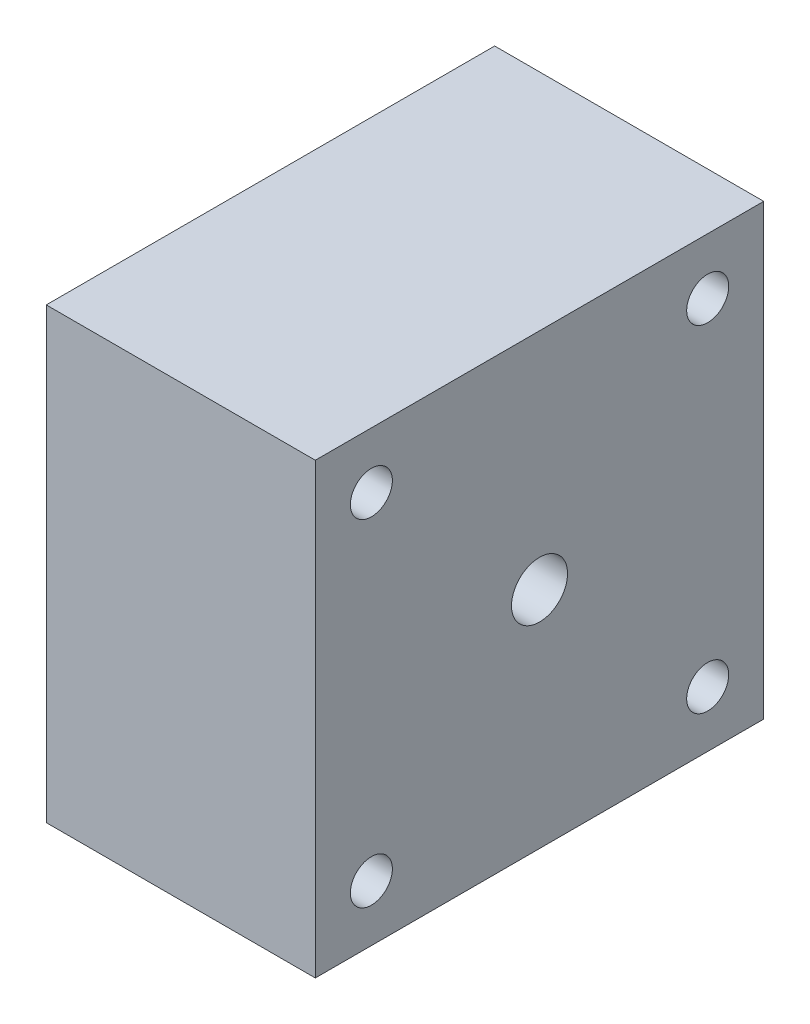
ISO-10303-21;
HEADER;
FILE_DESCRIPTION(('STEP AP214'),'2;1');
FILE_NAME('part.step','',(''),(''),'','','');
FILE_SCHEMA(('AUTOMOTIVE_DESIGN { 1 0 10303 214 1 1 1 1 }'));
ENDSEC;
DATA;
#1=APPLICATION_CONTEXT('core data for automotive mechanical design processes');
#2=APPLICATION_PROTOCOL_DEFINITION('international standard','automotive_design',2000,#1);
#3=PRODUCT_CONTEXT('',#1,'mechanical');
#4=PRODUCT('Part','Part','',(#3));
#5=PRODUCT_RELATED_PRODUCT_CATEGORY('part','',(#4));
#6=PRODUCT_DEFINITION_FORMATION('','',#4);
#7=PRODUCT_DEFINITION_CONTEXT('part definition',#1,'design');
#8=PRODUCT_DEFINITION('design','',#6,#7);
#9=PRODUCT_DEFINITION_SHAPE('','',#8);
#10=(LENGTH_UNIT() NAMED_UNIT(*) SI_UNIT(.MILLI.,.METRE.));
#11=(NAMED_UNIT(*) PLANE_ANGLE_UNIT() SI_UNIT($,.RADIAN.));
#12=(NAMED_UNIT(*) SI_UNIT($,.STERADIAN.) SOLID_ANGLE_UNIT());
#13=UNCERTAINTY_MEASURE_WITH_UNIT(LENGTH_MEASURE(1.E-05),#10,'distance_accuracy_value','');
#14=(GEOMETRIC_REPRESENTATION_CONTEXT(3) GLOBAL_UNCERTAINTY_ASSIGNED_CONTEXT((#13)) GLOBAL_UNIT_ASSIGNED_CONTEXT((#10,
#11,#12)) REPRESENTATION_CONTEXT('',''));
#15=CARTESIAN_POINT('',(0.,0.,0.));
#16=DIRECTION('',(0.,0.,1.));
#17=DIRECTION('',(1.,0.,0.));
#18=AXIS2_PLACEMENT_3D('',#15,#16,#17);
#19=CARTESIAN_POINT('',(0.,50.8,0.));
#20=DIRECTION('',(-1.,0.,0.));
#21=DIRECTION('',(0.,0.,1.));
#22=AXIS2_PLACEMENT_3D('',#19,#20,#21);
#23=PLANE('',#22);
#24=CARTESIAN_POINT('',(0.,30.1624999999995,-33.6488919710466));
#25=DIRECTION('',(-1.,0.,0.));
#26=DIRECTION('',(0.,0.,1.));
#27=AXIS2_PLACEMENT_3D('',#24,#25,#26);
#28=CIRCLE('',#27,1.8288);
#29=CARTESIAN_POINT('',(0.,30.1624999999995,-31.8200919710466));
#30=VERTEX_POINT('',#29);
#31=EDGE_CURVE('E415',#30,#30,#28,.T.);
#32=ORIENTED_EDGE('',*,*,#31,.F.);
#33=EDGE_LOOP('',(#32));
#34=FACE_BOUND('',#33,.T.);
#35=CARTESIAN_POINT('',(0.,20.6374999999995,-33.6488919710461));
#36=DIRECTION('',(-1.,0.,0.));
#37=DIRECTION('',(0.,0.,1.));
#38=AXIS2_PLACEMENT_3D('',#35,#36,#37);
#39=CIRCLE('',#38,1.8288);
#40=CARTESIAN_POINT('',(0.,20.6374999999995,-31.8200919710461));
#41=VERTEX_POINT('',#40);
#42=EDGE_CURVE('E409',#41,#41,#39,.T.);
#43=ORIENTED_EDGE('',*,*,#42,.F.);
#44=EDGE_LOOP('',(#43));
#45=FACE_BOUND('',#44,.T.);
#46=CARTESIAN_POINT('',(0.,15.8749999999999,-25.3999999999991));
#47=DIRECTION('',(-1.,0.,0.));
#48=DIRECTION('',(0.,0.,1.));
#49=AXIS2_PLACEMENT_3D('',#46,#47,#48);
#50=CIRCLE('',#49,1.8288);
#51=CARTESIAN_POINT('',(0.,15.8749999999999,-23.5711999999991));
#52=VERTEX_POINT('',#51);
#53=EDGE_CURVE('E403',#52,#52,#50,.T.);
#54=ORIENTED_EDGE('',*,*,#53,.F.);
#55=EDGE_LOOP('',(#54));
#56=FACE_BOUND('',#55,.T.);
#57=CARTESIAN_POINT('',(0.,20.6375000000003,-17.1511080289525));
#58=DIRECTION('',(-1.,0.,0.));
#59=DIRECTION('',(0.,0.,1.));
#60=AXIS2_PLACEMENT_3D('',#57,#58,#59);
#61=CIRCLE('',#60,1.8288);
#62=CARTESIAN_POINT('',(0.,20.6375000000003,-15.3223080289525));
#63=VERTEX_POINT('',#62);
#64=EDGE_CURVE('E397',#63,#63,#61,.T.);
#65=ORIENTED_EDGE('',*,*,#64,.F.);
#66=EDGE_LOOP('',(#65));
#67=FACE_BOUND('',#66,.T.);
#68=CARTESIAN_POINT('',(0.,30.1625000000003,-17.151108028953));
#69=DIRECTION('',(-1.,0.,0.));
#70=DIRECTION('',(0.,0.,1.));
#71=AXIS2_PLACEMENT_3D('',#68,#69,#70);
#72=CIRCLE('',#71,1.8288);
#73=CARTESIAN_POINT('',(0.,30.1625000000003,-15.322308028953));
#74=VERTEX_POINT('',#73);
#75=EDGE_CURVE('E388',#74,#74,#72,.T.);
#76=ORIENTED_EDGE('',*,*,#75,.F.);
#77=EDGE_LOOP('',(#76));
#78=FACE_BOUND('',#77,.T.);
#79=CARTESIAN_POINT('',(0.,34.9249999999999,-25.4));
#80=DIRECTION('',(-1.,0.,0.));
#81=DIRECTION('',(0.,0.,1.));
#82=AXIS2_PLACEMENT_3D('',#79,#80,#81);
#83=CIRCLE('',#82,1.8288);
#84=CARTESIAN_POINT('',(0.,34.9249999999999,-23.5712));
#85=VERTEX_POINT('',#84);
#86=EDGE_CURVE('E138',#85,#85,#83,.T.);
#87=ORIENTED_EDGE('',*,*,#86,.F.);
#88=EDGE_LOOP('',(#87));
#89=FACE_BOUND('',#88,.T.);
#90=CARTESIAN_POINT('',(0.,25.3999999999999,-25.4));
#91=DIRECTION('',(-1.,0.,0.));
#92=DIRECTION('',(0.,0.,1.));
#93=AXIS2_PLACEMENT_3D('',#90,#91,#92);
#94=CIRCLE('',#93,7.1501);
#95=CARTESIAN_POINT('',(0.,25.3999999999999,-18.2499));
#96=VERTEX_POINT('',#95);
#97=EDGE_CURVE('E129',#96,#96,#94,.F.);
#98=ORIENTED_EDGE('',*,*,#97,.T.);
#99=EDGE_LOOP('',(#98));
#100=FACE_BOUND('',#99,.T.);
#101=CARTESIAN_POINT('',(0.,44.4500000000001,-44.4499999999801));
#102=DIRECTION('',(-1.,0.,0.));
#103=DIRECTION('',(0.,0.,1.));
#104=AXIS2_PLACEMENT_3D('',#101,#102,#103);
#105=CIRCLE('',#104,2.38125);
#106=CARTESIAN_POINT('',(0.,44.4500000000001,-42.0687499999801));
#107=VERTEX_POINT('',#106);
#108=EDGE_CURVE('E119',#107,#107,#105,.F.);
#109=ORIENTED_EDGE('',*,*,#108,.T.);
#110=EDGE_LOOP('',(#109));
#111=FACE_BOUND('',#110,.T.);
#112=CARTESIAN_POINT('',(0.,6.35000000000006,-44.4499999999802));
#113=DIRECTION('',(-1.,0.,0.));
#114=DIRECTION('',(0.,0.,1.));
#115=AXIS2_PLACEMENT_3D('',#112,#113,#114);
#116=CIRCLE('',#115,2.38125);
#117=CARTESIAN_POINT('',(0.,6.35000000000006,-42.0687499999801));
#118=VERTEX_POINT('',#117);
#119=EDGE_CURVE('E110',#118,#118,#116,.F.);
#120=ORIENTED_EDGE('',*,*,#119,.T.);
#121=EDGE_LOOP('',(#120));
#122=FACE_BOUND('',#121,.T.);
#123=DIRECTION('',(0.,-1.,0.));
#124=VECTOR('',#123,1.);
#125=CARTESIAN_POINT('',(0.,0.,0.));
#126=LINE('',#125,#124);
#127=CARTESIAN_POINT('',(0.,50.8,0.));
#128=VERTEX_POINT('',#127);
#129=CARTESIAN_POINT('',(0.,0.,0.));
#130=VERTEX_POINT('',#129);
#131=EDGE_CURVE('E101',#128,#130,#126,.T.);
#132=ORIENTED_EDGE('',*,*,#131,.F.);
#133=DIRECTION('',(0.,0.,1.));
#134=VECTOR('',#133,1.);
#135=CARTESIAN_POINT('',(0.,50.8,0.));
#136=LINE('',#135,#134);
#137=CARTESIAN_POINT('',(0.,50.8,-50.8));
#138=VERTEX_POINT('',#137);
#139=EDGE_CURVE('E75',#138,#128,#136,.T.);
#140=ORIENTED_EDGE('',*,*,#139,.F.);
#141=DIRECTION('',(0.,1.,0.));
#142=VECTOR('',#141,1.);
#143=CARTESIAN_POINT('',(0.,0.,-50.8));
#144=LINE('',#143,#142);
#145=CARTESIAN_POINT('',(0.,0.,-50.8));
#146=VERTEX_POINT('',#145);
#147=EDGE_CURVE('E69',#146,#138,#144,.T.);
#148=ORIENTED_EDGE('',*,*,#147,.F.);
#149=DIRECTION('',(0.,0.,-1.));
#150=VECTOR('',#149,1.);
#151=CARTESIAN_POINT('',(0.,0.,0.));
#152=LINE('',#151,#150);
#153=EDGE_CURVE('E92',#130,#146,#152,.T.);
#154=ORIENTED_EDGE('',*,*,#153,.F.);
#155=EDGE_LOOP('',(#132,#140,#148,#154));
#156=FACE_BOUND('',#155,.T.);
#157=CARTESIAN_POINT('',(0.,44.4500000000118,-6.34999999996307));
#158=DIRECTION('',(-1.,0.,0.));
#159=DIRECTION('',(0.,0.,1.));
#160=AXIS2_PLACEMENT_3D('',#157,#158,#159);
#161=CIRCLE('',#160,2.38125);
#162=CARTESIAN_POINT('',(0.,44.4500000000118,-3.96874999996307));
#163=VERTEX_POINT('',#162);
#164=EDGE_CURVE('E115',#163,#163,#161,.F.);
#165=ORIENTED_EDGE('',*,*,#164,.T.);
#166=EDGE_LOOP('',(#165));
#167=FACE_BOUND('',#166,.T.);
#168=CARTESIAN_POINT('',(0.,6.35000000000004,-6.34999999998015));
#169=DIRECTION('',(-1.,0.,0.));
#170=DIRECTION('',(0.,0.,1.));
#171=AXIS2_PLACEMENT_3D('',#168,#169,#170);
#172=CIRCLE('',#171,2.38125);
#173=CARTESIAN_POINT('',(0.,6.35000000000004,-3.96874999998015));
#174=VERTEX_POINT('',#173);
#175=EDGE_CURVE('E122',#174,#174,#172,.F.);
#176=ORIENTED_EDGE('',*,*,#175,.T.);
#177=EDGE_LOOP('',(#176));
#178=FACE_BOUND('',#177,.T.);
#179=ADVANCED_FACE('F33',(#34,#45,#56,#67,#78,#89,#100,#111,#122,#156,#167,#178),#23,.T.);
#180=CARTESIAN_POINT('',(30.48,50.8,0.));
#181=DIRECTION('',(-1.,0.,0.));
#182=DIRECTION('',(0.,0.,1.));
#183=AXIS2_PLACEMENT_3D('',#180,#181,#182);
#184=PLANE('',#183);
#185=CARTESIAN_POINT('',(30.48,44.4500000000001,-44.4499999999799));
#186=DIRECTION('',(-1.,0.,0.));
#187=DIRECTION('',(0.,0.,1.));
#188=AXIS2_PLACEMENT_3D('',#185,#186,#187);
#189=CIRCLE('',#188,2.38125);
#190=CARTESIAN_POINT('',(30.48,44.4500000000001,-42.0687499999799));
#191=VERTEX_POINT('',#190);
#192=EDGE_CURVE('E118',#191,#191,#189,.F.);
#193=ORIENTED_EDGE('',*,*,#192,.F.);
#194=EDGE_LOOP('',(#193));
#195=FACE_BOUND('',#194,.T.);
#196=CARTESIAN_POINT('',(30.48,6.35000000000005,-44.44999999998));
#197=DIRECTION('',(-1.,0.,0.));
#198=DIRECTION('',(0.,0.,1.));
#199=AXIS2_PLACEMENT_3D('',#196,#197,#198);
#200=CIRCLE('',#199,2.38125);
#201=CARTESIAN_POINT('',(30.48,6.35000000000005,-42.0687499999799));
#202=VERTEX_POINT('',#201);
#203=EDGE_CURVE('E113',#202,#202,#200,.F.);
#204=ORIENTED_EDGE('',*,*,#203,.F.);
#205=EDGE_LOOP('',(#204));
#206=FACE_BOUND('',#205,.T.);
#207=DIRECTION('',(0.,-1.,0.));
#208=VECTOR('',#207,1.);
#209=CARTESIAN_POINT('',(30.48,0.,0.));
#210=LINE('',#209,#208);
#211=CARTESIAN_POINT('',(30.48,50.8,0.));
#212=VERTEX_POINT('',#211);
#213=CARTESIAN_POINT('',(30.48,0.,0.));
#214=VERTEX_POINT('',#213);
#215=EDGE_CURVE('E88',#212,#214,#210,.T.);
#216=ORIENTED_EDGE('',*,*,#215,.T.);
#217=DIRECTION('',(0.,0.,-1.));
#218=VECTOR('',#217,1.);
#219=CARTESIAN_POINT('',(30.48,0.,0.));
#220=LINE('',#219,#218);
#221=CARTESIAN_POINT('',(30.48,0.,-50.8));
#222=VERTEX_POINT('',#221);
#223=EDGE_CURVE('E82',#214,#222,#220,.T.);
#224=ORIENTED_EDGE('',*,*,#223,.T.);
#225=DIRECTION('',(0.,1.,0.));
#226=VECTOR('',#225,1.);
#227=CARTESIAN_POINT('',(30.48,0.,-50.8));
#228=LINE('',#227,#226);
#229=CARTESIAN_POINT('',(30.48,50.8,-50.8));
#230=VERTEX_POINT('',#229);
#231=EDGE_CURVE('E86',#222,#230,#228,.T.);
#232=ORIENTED_EDGE('',*,*,#231,.T.);
#233=DIRECTION('',(0.,0.,1.));
#234=VECTOR('',#233,1.);
#235=CARTESIAN_POINT('',(30.48,50.8,0.));
#236=LINE('',#235,#234);
#237=EDGE_CURVE('E52',#230,#212,#236,.T.);
#238=ORIENTED_EDGE('',*,*,#237,.T.);
#239=EDGE_LOOP('',(#216,#224,#232,#238));
#240=FACE_BOUND('',#239,.T.);
#241=CARTESIAN_POINT('',(30.48,25.4,-25.4));
#242=DIRECTION('',(-1.,0.,0.));
#243=DIRECTION('',(0.,0.,1.));
#244=AXIS2_PLACEMENT_3D('',#241,#242,#243);
#245=CIRCLE('',#244,3.175);
#246=CARTESIAN_POINT('',(30.48,26.7918357861171,-28.2536674901754));
#247=VERTEX_POINT('',#246);
#248=EDGE_CURVE('E104',#247,#247,#245,.F.);
#249=ORIENTED_EDGE('',*,*,#248,.F.);
#250=EDGE_LOOP('',(#249));
#251=FACE_BOUND('',#250,.T.);
#252=CARTESIAN_POINT('',(30.48,44.4500000000118,-6.34999999996307));
#253=DIRECTION('',(-1.,0.,0.));
#254=DIRECTION('',(0.,0.,1.));
#255=AXIS2_PLACEMENT_3D('',#252,#253,#254);
#256=CIRCLE('',#255,2.38125);
#257=CARTESIAN_POINT('',(30.48,44.4500000000118,-3.96874999996307));
#258=VERTEX_POINT('',#257);
#259=EDGE_CURVE('E114',#258,#258,#256,.F.);
#260=ORIENTED_EDGE('',*,*,#259,.F.);
#261=EDGE_LOOP('',(#260));
#262=FACE_BOUND('',#261,.T.);
#263=CARTESIAN_POINT('',(30.48,6.35000000000004,-6.34999999997995));
#264=DIRECTION('',(-1.,0.,0.));
#265=DIRECTION('',(0.,0.,1.));
#266=AXIS2_PLACEMENT_3D('',#263,#264,#265);
#267=CIRCLE('',#266,2.38125);
#268=CARTESIAN_POINT('',(30.48,6.35000000000004,-3.96874999997995));
#269=VERTEX_POINT('',#268);
#270=EDGE_CURVE('E121',#269,#269,#267,.F.);
#271=ORIENTED_EDGE('',*,*,#270,.F.);
#272=EDGE_LOOP('',(#271));
#273=FACE_BOUND('',#272,.T.);
#274=ADVANCED_FACE('F83',(#195,#206,#240,#251,#262,#273),#184,.F.);
#275=CARTESIAN_POINT('',(30.48,0.,0.));
#276=DIRECTION('',(0.,0.,-1.));
#277=DIRECTION('',(-1.,0.,0.));
#278=AXIS2_PLACEMENT_3D('',#275,#276,#277);
#279=PLANE('',#278);
#280=ORIENTED_EDGE('',*,*,#131,.T.);
#281=DIRECTION('',(-1.,0.,0.));
#282=VECTOR('',#281,1.);
#283=CARTESIAN_POINT('',(30.48,0.,0.));
#284=LINE('',#283,#282);
#285=EDGE_CURVE('E11',#214,#130,#284,.T.);
#286=ORIENTED_EDGE('',*,*,#285,.F.);
#287=ORIENTED_EDGE('',*,*,#215,.F.);
#288=DIRECTION('',(-1.,0.,0.));
#289=VECTOR('',#288,1.);
#290=CARTESIAN_POINT('',(30.48,50.8,0.));
#291=LINE('',#290,#289);
#292=EDGE_CURVE('E97',#212,#128,#291,.T.);
#293=ORIENTED_EDGE('',*,*,#292,.T.);
#294=EDGE_LOOP('',(#280,#286,#287,#293));
#295=FACE_BOUND('',#294,.T.);
#296=ADVANCED_FACE('F35',(#295),#279,.F.);
#297=CARTESIAN_POINT('',(30.48,0.,0.));
#298=DIRECTION('',(0.,1.,0.));
#299=DIRECTION('',(0.,0.,1.));
#300=AXIS2_PLACEMENT_3D('',#297,#298,#299);
#301=PLANE('',#300);
#302=ORIENTED_EDGE('',*,*,#153,.T.);
#303=DIRECTION('',(-1.,0.,0.));
#304=VECTOR('',#303,1.);
#305=CARTESIAN_POINT('',(30.48,0.,-50.8));
#306=LINE('',#305,#304);
#307=EDGE_CURVE('E43',#222,#146,#306,.T.);
#308=ORIENTED_EDGE('',*,*,#307,.F.);
#309=ORIENTED_EDGE('',*,*,#223,.F.);
#310=ORIENTED_EDGE('',*,*,#285,.T.);
#311=EDGE_LOOP('',(#302,#308,#309,#310));
#312=FACE_BOUND('',#311,.T.);
#313=ADVANCED_FACE('F91',(#312),#301,.F.);
#314=CARTESIAN_POINT('',(30.48,0.,-50.8));
#315=DIRECTION('',(0.,0.,1.));
#316=DIRECTION('',(1.,0.,0.));
#317=AXIS2_PLACEMENT_3D('',#314,#315,#316);
#318=PLANE('',#317);
#319=ORIENTED_EDGE('',*,*,#147,.T.);
#320=DIRECTION('',(-1.,0.,0.));
#321=VECTOR('',#320,1.);
#322=CARTESIAN_POINT('',(30.48,50.8,-50.8));
#323=LINE('',#322,#321);
#324=EDGE_CURVE('E93',#230,#138,#323,.T.);
#325=ORIENTED_EDGE('',*,*,#324,.F.);
#326=ORIENTED_EDGE('',*,*,#231,.F.);
#327=ORIENTED_EDGE('',*,*,#307,.T.);
#328=EDGE_LOOP('',(#319,#325,#326,#327));
#329=FACE_BOUND('',#328,.T.);
#330=ADVANCED_FACE('F95',(#329),#318,.F.);
#331=CARTESIAN_POINT('',(30.48,50.8,0.));
#332=DIRECTION('',(0.,-1.,0.));
#333=DIRECTION('',(0.,0.,-1.));
#334=AXIS2_PLACEMENT_3D('',#331,#332,#333);
#335=PLANE('',#334);
#336=ORIENTED_EDGE('',*,*,#139,.T.);
#337=ORIENTED_EDGE('',*,*,#292,.F.);
#338=ORIENTED_EDGE('',*,*,#237,.F.);
#339=ORIENTED_EDGE('',*,*,#324,.T.);
#340=EDGE_LOOP('',(#336,#337,#338,#339));
#341=FACE_BOUND('',#340,.T.);
#342=ADVANCED_FACE('F185',(#341),#335,.F.);
#343=CARTESIAN_POINT('',(-16.0827684200193,25.4,-25.4));
#344=DIRECTION('',(1.,0.,0.));
#345=DIRECTION('',(0.,0.438373475942388,-0.898792910291458));
#346=AXIS2_PLACEMENT_3D('',#343,#344,#345);
#347=CYLINDRICAL_SURFACE('',#346,3.175);
#348=CARTESIAN_POINT('',(24.13,25.4,-25.4));
#349=DIRECTION('',(1.,0.,0.));
#350=DIRECTION('',(0.,0.,-1.));
#351=AXIS2_PLACEMENT_3D('',#348,#349,#350);
#352=CIRCLE('',#351,3.175);
#353=CARTESIAN_POINT('',(24.13,26.7918357861171,-28.2536674901754));
#354=VERTEX_POINT('',#353);
#355=EDGE_CURVE('E37',#354,#354,#352,.T.);
#356=CARTESIAN_POINT('',(24.13,26.7918357861171,-28.2536674901754));
#357=CARTESIAN_POINT('',(24.1961458333334,26.7918357861171,-28.2536674901754));
#358=CARTESIAN_POINT('',(24.2622916666667,26.7918357861171,-28.2536674901754));
#359=CARTESIAN_POINT('',(24.3945833333334,26.7918357861171,-28.2536674901754));
#360=CARTESIAN_POINT('',(24.4607291666667,26.7918357861171,-28.2536674901754));
#361=CARTESIAN_POINT('',(24.5930208333334,26.7918357861171,-28.2536674901754));
#362=CARTESIAN_POINT('',(24.6591666666667,26.7918357861171,-28.2536674901754));
#363=CARTESIAN_POINT('',(24.7914583333334,26.7918357861171,-28.2536674901754));
#364=CARTESIAN_POINT('',(24.8576041666667,26.7918357861171,-28.2536674901754));
#365=CARTESIAN_POINT('',(24.9898958333334,26.7918357861171,-28.2536674901754));
#366=CARTESIAN_POINT('',(25.0560416666667,26.7918357861171,-28.2536674901754));
#367=CARTESIAN_POINT('',(25.1883333333334,26.7918357861171,-28.2536674901754));
#368=CARTESIAN_POINT('',(25.2544791666667,26.7918357861171,-28.2536674901754));
#369=CARTESIAN_POINT('',(25.3867708333334,26.7918357861171,-28.2536674901754));
#370=CARTESIAN_POINT('',(25.4529166666667,26.7918357861171,-28.2536674901754));
#371=CARTESIAN_POINT('',(25.5852083333334,26.7918357861171,-28.2536674901754));
#372=CARTESIAN_POINT('',(25.6513541666667,26.7918357861171,-28.2536674901754));
#373=CARTESIAN_POINT('',(25.7836458333334,26.7918357861171,-28.2536674901754));
#374=CARTESIAN_POINT('',(25.8497916666667,26.7918357861171,-28.2536674901754));
#375=CARTESIAN_POINT('',(25.9820833333333,26.7918357861171,-28.2536674901754));
#376=CARTESIAN_POINT('',(26.0482291666667,26.7918357861171,-28.2536674901754));
#377=CARTESIAN_POINT('',(26.1805208333334,26.7918357861171,-28.2536674901754));
#378=CARTESIAN_POINT('',(26.2466666666667,26.7918357861171,-28.2536674901754));
#379=CARTESIAN_POINT('',(26.3789583333334,26.7918357861171,-28.2536674901754));
#380=CARTESIAN_POINT('',(26.4451041666667,26.7918357861171,-28.2536674901754));
#381=CARTESIAN_POINT('',(26.5773958333333,26.7918357861171,-28.2536674901754));
#382=CARTESIAN_POINT('',(26.6435416666667,26.7918357861171,-28.2536674901754));
#383=CARTESIAN_POINT('',(26.7758333333333,26.7918357861171,-28.2536674901754));
#384=CARTESIAN_POINT('',(26.8419791666667,26.7918357861171,-28.2536674901754));
#385=CARTESIAN_POINT('',(26.9742708333333,26.7918357861171,-28.2536674901754));
#386=CARTESIAN_POINT('',(27.0404166666667,26.7918357861171,-28.2536674901754));
#387=CARTESIAN_POINT('',(27.1727083333333,26.7918357861171,-28.2536674901754));
#388=CARTESIAN_POINT('',(27.2388541666667,26.7918357861171,-28.2536674901754));
#389=CARTESIAN_POINT('',(27.3711458333333,26.7918357861171,-28.2536674901754));
#390=CARTESIAN_POINT('',(27.4372916666667,26.7918357861171,-28.2536674901754));
#391=CARTESIAN_POINT('',(27.5695833333333,26.7918357861171,-28.2536674901754));
#392=CARTESIAN_POINT('',(27.6357291666667,26.7918357861171,-28.2536674901754));
#393=CARTESIAN_POINT('',(27.7680208333333,26.7918357861171,-28.2536674901754));
#394=CARTESIAN_POINT('',(27.8341666666667,26.7918357861171,-28.2536674901754));
#395=CARTESIAN_POINT('',(27.9664583333333,26.7918357861171,-28.2536674901754));
#396=CARTESIAN_POINT('',(28.0326041666667,26.7918357861171,-28.2536674901754));
#397=CARTESIAN_POINT('',(28.1648958333333,26.7918357861171,-28.2536674901754));
#398=CARTESIAN_POINT('',(28.2310416666667,26.7918357861171,-28.2536674901754));
#399=CARTESIAN_POINT('',(28.3633333333333,26.7918357861171,-28.2536674901754));
#400=CARTESIAN_POINT('',(28.4294791666667,26.7918357861171,-28.2536674901754));
#401=CARTESIAN_POINT('',(28.5617708333333,26.7918357861171,-28.2536674901754));
#402=CARTESIAN_POINT('',(28.6279166666667,26.7918357861171,-28.2536674901754));
#403=CARTESIAN_POINT('',(28.7602083333333,26.7918357861171,-28.2536674901754));
#404=CARTESIAN_POINT('',(28.8263541666667,26.7918357861171,-28.2536674901754));
#405=CARTESIAN_POINT('',(28.9586458333333,26.7918357861171,-28.2536674901754));
#406=CARTESIAN_POINT('',(29.0247916666667,26.7918357861171,-28.2536674901754));
#407=CARTESIAN_POINT('',(29.1570833333333,26.7918357861171,-28.2536674901754));
#408=CARTESIAN_POINT('',(29.2232291666667,26.7918357861171,-28.2536674901754));
#409=CARTESIAN_POINT('',(29.3555208333333,26.7918357861171,-28.2536674901754));
#410=CARTESIAN_POINT('',(29.4216666666667,26.7918357861171,-28.2536674901754));
#411=CARTESIAN_POINT('',(29.5539583333333,26.7918357861171,-28.2536674901754));
#412=CARTESIAN_POINT('',(29.6201041666667,26.7918357861171,-28.2536674901754));
#413=CARTESIAN_POINT('',(29.7523958333333,26.7918357861171,-28.2536674901754));
#414=CARTESIAN_POINT('',(29.8185416666667,26.7918357861171,-28.2536674901754));
#415=CARTESIAN_POINT('',(29.9508333333333,26.7918357861171,-28.2536674901754));
#416=CARTESIAN_POINT('',(30.0169791666667,26.7918357861171,-28.2536674901754));
#417=CARTESIAN_POINT('',(30.1492708333333,26.7918357861171,-28.2536674901754));
#418=CARTESIAN_POINT('',(30.2154166666667,26.7918357861171,-28.2536674901754));
#419=CARTESIAN_POINT('',(30.3477083333333,26.7918357861171,-28.2536674901754));
#420=CARTESIAN_POINT('',(30.4138541666667,26.7918357861171,-28.2536674901754));
#421=CARTESIAN_POINT('',(30.48,26.7918357861171,-28.2536674901754));
#422=B_SPLINE_CURVE_WITH_KNOTS('',3,(#356,#357,#358,#359,#360,#361,#362,#363,#364,#365,#366,
#367,#368,#369,#370,#371,#372,#373,#374,#375,#376,#377,#378,#379,#380,#381,#382,#383,#384,#385,
#386,#387,#388,#389,#390,#391,#392,#393,#394,#395,#396,#397,#398,#399,#400,#401,#402,#403,#404,
#405,#406,#407,#408,#409,#410,#411,#412,#413,#414,#415,#416,#417,#418,#419,#420,#421),
.UNSPECIFIED.,.F.,.F.,(4,2,2,2,2,2,2,2,2,2,2,2,2,2,2,2,2,2,2,2,2,2,2,2,2,2,2,2,2,2,2,2,4),(0.,
0.198437499999995,0.396874999999998,0.5953125,0.793749999999996,0.992187499999991,
1.19062499999999,1.3890625,1.58749999999999,1.78593749999999,1.98437499999999,2.18281249999999,
2.38124999999999,2.57968749999998,2.77812499999999,2.97656249999999,3.17499999999998,
3.37343749999998,3.57187499999998,3.77031249999998,3.96874999999998,4.16718749999997,
4.36562499999998,4.56406249999998,4.76249999999998,4.96093749999997,5.15937499999997,
5.35781249999998,5.55624999999997,5.75468749999997,5.95312499999997,6.15156249999997,
6.34999999999997),.UNSPECIFIED.);
#423=EDGE_CURVE('BSEAM151',#354,#247,#422,.T.);
#424=ORIENTED_EDGE('',*,*,#355,.F.);
#425=ORIENTED_EDGE('',*,*,#248,.T.);
#426=ORIENTED_EDGE('',*,*,#423,.T.);
#427=ORIENTED_EDGE('',*,*,#423,.F.);
#428=EDGE_LOOP('',(#424,#426,#425,#427));
#429=FACE_BOUND('',#428,.T.);
#430=ADVANCED_FACE('F151',(#429),#347,.F.);
#431=CARTESIAN_POINT('',(-48.8487684200226,6.35000000000006,-44.4499999999805));
#432=DIRECTION('',(1.,0.,0.));
#433=DIRECTION('',(0.,0.71121192391603,-0.70297766627373));
#434=AXIS2_PLACEMENT_3D('',#431,#432,#433);
#435=CYLINDRICAL_SURFACE('',#434,2.38125);
#436=ORIENTED_EDGE('',*,*,#119,.F.);
#437=EDGE_LOOP('',(#436));
#438=FACE_BOUND('',#437,.T.);
#439=ORIENTED_EDGE('',*,*,#203,.T.);
#440=EDGE_LOOP('',(#439));
#441=FACE_BOUND('',#440,.T.);
#442=ADVANCED_FACE('F203',(#438,#441),#435,.F.);
#443=CARTESIAN_POINT('',(-48.8487684200611,44.4500000000118,-6.34999999996307));
#444=DIRECTION('',(1.,0.,0.));
#445=DIRECTION('',(0.,0.52642426037138,0.850222028703353));
#446=AXIS2_PLACEMENT_3D('',#443,#444,#445);
#447=CYLINDRICAL_SURFACE('',#446,2.38125);
#448=ORIENTED_EDGE('',*,*,#164,.F.);
#449=EDGE_LOOP('',(#448));
#450=FACE_BOUND('',#449,.T.);
#451=ORIENTED_EDGE('',*,*,#259,.T.);
#452=EDGE_LOOP('',(#451));
#453=FACE_BOUND('',#452,.T.);
#454=ADVANCED_FACE('F172',(#450,#453),#447,.F.);
#455=CARTESIAN_POINT('',(-48.8487684200227,44.4500000000001,-44.4499999999804));
#456=DIRECTION('',(1.,0.,0.));
#457=DIRECTION('',(0.,-0.82075836964807,-0.571275501533753));
#458=AXIS2_PLACEMENT_3D('',#455,#456,#457);
#459=CYLINDRICAL_SURFACE('',#458,2.38125);
#460=ORIENTED_EDGE('',*,*,#108,.F.);
#461=EDGE_LOOP('',(#460));
#462=FACE_BOUND('',#461,.T.);
#463=ORIENTED_EDGE('',*,*,#192,.T.);
#464=EDGE_LOOP('',(#463));
#465=FACE_BOUND('',#464,.T.);
#466=ADVANCED_FACE('F163',(#462,#465),#459,.F.);
#467=CARTESIAN_POINT('',(-48.8487684200231,6.35000000000005,-6.34999999998047));
#468=DIRECTION('',(1.,0.,0.));
#469=DIRECTION('',(0.,0.,-1.));
#470=AXIS2_PLACEMENT_3D('',#467,#468,#469);
#471=CYLINDRICAL_SURFACE('',#470,2.38125);
#472=ORIENTED_EDGE('',*,*,#175,.F.);
#473=EDGE_LOOP('',(#472));
#474=FACE_BOUND('',#473,.T.);
#475=ORIENTED_EDGE('',*,*,#270,.T.);
#476=EDGE_LOOP('',(#475));
#477=FACE_BOUND('',#476,.T.);
#478=ADVANCED_FACE('F160',(#474,#477),#471,.F.);
#479=CARTESIAN_POINT('',(24.13,25.3999999999999,-25.3999999999998));
#480=DIRECTION('',(1.,0.,0.));
#481=DIRECTION('',(0.,0.,-1.));
#482=AXIS2_PLACEMENT_3D('',#479,#480,#481);
#483=PLANE('',#482);
#484=ORIENTED_EDGE('',*,*,#355,.T.);
#485=EDGE_LOOP('',(#484));
#486=FACE_BOUND('',#485,.T.);
#487=CARTESIAN_POINT('',(24.13,25.3999999999999,-25.3999999999998));
#488=DIRECTION('',(1.,0.,0.));
#489=DIRECTION('',(0.,0.,-1.));
#490=AXIS2_PLACEMENT_3D('',#487,#488,#489);
#491=CIRCLE('',#490,7.1501);
#492=CARTESIAN_POINT('',(24.13,25.3999999999999,-18.2498999999998));
#493=VERTEX_POINT('',#492);
#494=EDGE_CURVE('E133',#493,#493,#491,.T.);
#495=ORIENTED_EDGE('',*,*,#494,.F.);
#496=EDGE_LOOP('',(#495));
#497=FACE_BOUND('',#496,.T.);
#498=ADVANCED_FACE('F162',(#486,#497),#483,.F.);
#499=CARTESIAN_POINT('',(24.13,25.3999999999999,-25.3999999999998));
#500=DIRECTION('',(-1.,0.,0.));
#501=DIRECTION('',(0.,0.,1.));
#502=AXIS2_PLACEMENT_3D('',#499,#500,#501);
#503=CYLINDRICAL_SURFACE('',#502,7.1501);
#504=CARTESIAN_POINT('',(24.13,25.3999999999999,-18.2498999999998));
#505=CARTESIAN_POINT('',(23.8786458333333,25.3999999999999,-18.2498999999998));
#506=CARTESIAN_POINT('',(23.6272916666666,25.3999999999999,-18.2498999999998));
#507=CARTESIAN_POINT('',(23.1245833333333,25.3999999999999,-18.2498999999999));
#508=CARTESIAN_POINT('',(22.8732291666666,25.3999999999999,-18.2498999999999));
#509=CARTESIAN_POINT('',(22.3705208333333,25.3999999999999,-18.2498999999999));
#510=CARTESIAN_POINT('',(22.1191666666666,25.3999999999999,-18.2498999999999));
#511=CARTESIAN_POINT('',(21.6164583333333,25.3999999999999,-18.2498999999999));
#512=CARTESIAN_POINT('',(21.3651041666666,25.3999999999999,-18.2498999999999));
#513=CARTESIAN_POINT('',(20.8623958333333,25.3999999999999,-18.2498999999999));
#514=CARTESIAN_POINT('',(20.6110416666666,25.3999999999999,-18.2498999999999));
#515=CARTESIAN_POINT('',(20.1083333333333,25.3999999999999,-18.2498999999999));
#516=CARTESIAN_POINT('',(19.8569791666666,25.3999999999999,-18.2498999999999));
#517=CARTESIAN_POINT('',(19.3542708333333,25.3999999999999,-18.2498999999999));
#518=CARTESIAN_POINT('',(19.1029166666666,25.3999999999999,-18.2498999999999));
#519=CARTESIAN_POINT('',(18.6002083333333,25.3999999999999,-18.2498999999999));
#520=CARTESIAN_POINT('',(18.3488541666666,25.3999999999999,-18.2498999999999));
#521=CARTESIAN_POINT('',(17.8461458333333,25.3999999999999,-18.2498999999999));
#522=CARTESIAN_POINT('',(17.5947916666666,25.3999999999999,-18.2498999999999));
#523=CARTESIAN_POINT('',(17.0920833333333,25.3999999999999,-18.2498999999999));
#524=CARTESIAN_POINT('',(16.8407291666666,25.3999999999999,-18.2498999999999));
#525=CARTESIAN_POINT('',(16.3380208333333,25.3999999999999,-18.2498999999999));
#526=CARTESIAN_POINT('',(16.0866666666666,25.3999999999999,-18.2498999999999));
#527=CARTESIAN_POINT('',(15.5839583333333,25.3999999999999,-18.2498999999999));
#528=CARTESIAN_POINT('',(15.3326041666666,25.3999999999999,-18.2498999999999));
#529=CARTESIAN_POINT('',(14.8298958333333,25.3999999999999,-18.2498999999999));
#530=CARTESIAN_POINT('',(14.5785416666666,25.3999999999999,-18.2498999999999));
#531=CARTESIAN_POINT('',(14.0758333333333,25.3999999999999,-18.2498999999999));
#532=CARTESIAN_POINT('',(13.8244791666666,25.3999999999999,-18.2498999999999));
#533=CARTESIAN_POINT('',(13.3217708333333,25.3999999999999,-18.2498999999999));
#534=CARTESIAN_POINT('',(13.0704166666666,25.3999999999999,-18.2498999999999));
#535=CARTESIAN_POINT('',(12.5677083333333,25.3999999999999,-18.2498999999999));
#536=CARTESIAN_POINT('',(12.3163541666666,25.3999999999999,-18.2498999999999));
#537=CARTESIAN_POINT('',(11.8136458333333,25.3999999999999,-18.2498999999999));
#538=CARTESIAN_POINT('',(11.5622916666666,25.3999999999999,-18.2498999999999));
#539=CARTESIAN_POINT('',(11.0595833333333,25.3999999999999,-18.2498999999999));
#540=CARTESIAN_POINT('',(10.8082291666666,25.3999999999999,-18.2498999999999));
#541=CARTESIAN_POINT('',(10.3055208333333,25.3999999999999,-18.2498999999999));
#542=CARTESIAN_POINT('',(10.0541666666666,25.3999999999999,-18.2498999999999));
#543=CARTESIAN_POINT('',(9.55145833333329,25.3999999999999,-18.2498999999999));
#544=CARTESIAN_POINT('',(9.30010416666663,25.3999999999999,-18.2498999999999));
#545=CARTESIAN_POINT('',(8.79739583333329,25.3999999999999,-18.2499));
#546=CARTESIAN_POINT('',(8.54604166666663,25.3999999999999,-18.2499));
#547=CARTESIAN_POINT('',(8.0433333333333,25.3999999999999,-18.2499));
#548=CARTESIAN_POINT('',(7.79197916666663,25.3999999999999,-18.2499));
#549=CARTESIAN_POINT('',(7.2892708333333,25.3999999999999,-18.2499));
#550=CARTESIAN_POINT('',(7.03791666666663,25.3999999999999,-18.2499));
#551=CARTESIAN_POINT('',(6.5352083333333,25.3999999999999,-18.2499));
#552=CARTESIAN_POINT('',(6.28385416666663,25.3999999999999,-18.2499));
#553=CARTESIAN_POINT('',(5.7811458333333,25.3999999999999,-18.2499));
#554=CARTESIAN_POINT('',(5.52979166666663,25.3999999999999,-18.2499));
#555=CARTESIAN_POINT('',(5.0270833333333,25.3999999999999,-18.2499));
#556=CARTESIAN_POINT('',(4.77572916666663,25.3999999999999,-18.2499));
#557=CARTESIAN_POINT('',(4.2730208333333,25.3999999999999,-18.2499));
#558=CARTESIAN_POINT('',(4.02166666666663,25.3999999999999,-18.2499));
#559=CARTESIAN_POINT('',(3.5189583333333,25.3999999999999,-18.2499));
#560=CARTESIAN_POINT('',(3.26760416666663,25.3999999999999,-18.2499));
#561=CARTESIAN_POINT('',(2.7648958333333,25.3999999999999,-18.2499));
#562=CARTESIAN_POINT('',(2.51354166666663,25.3999999999999,-18.2499));
#563=CARTESIAN_POINT('',(2.01083333333329,25.3999999999999,-18.2499));
#564=CARTESIAN_POINT('',(1.75947916666663,25.3999999999999,-18.2499));
#565=CARTESIAN_POINT('',(1.25677083333329,25.3999999999999,-18.2499));
#566=CARTESIAN_POINT('',(1.00541666666663,25.3999999999999,-18.2499));
#567=CARTESIAN_POINT('',(0.502708333333295,25.3999999999999,-18.2499));
#568=CARTESIAN_POINT('',(0.251354166666628,25.3999999999999,-18.2499));
#569=CARTESIAN_POINT('',(0.,25.3999999999999,-18.2499));
#570=B_SPLINE_CURVE_WITH_KNOTS('',3,(#504,#505,#506,#507,#508,#509,#510,#511,#512,#513,#514,
#515,#516,#517,#518,#519,#520,#521,#522,#523,#524,#525,#526,#527,#528,#529,#530,#531,#532,#533,
#534,#535,#536,#537,#538,#539,#540,#541,#542,#543,#544,#545,#546,#547,#548,#549,#550,#551,#552,
#553,#554,#555,#556,#557,#558,#559,#560,#561,#562,#563,#564,#565,#566,#567,#568,#569),
.UNSPECIFIED.,.F.,.F.,(4,2,2,2,2,2,2,2,2,2,2,2,2,2,2,2,2,2,2,2,2,2,2,2,2,2,2,2,2,2,2,2,4),(0.,
0.754062500000003,1.508125,2.2621875,3.01625,3.7703125,4.524375,5.2784375,6.0325,6.7865625,
7.540625,8.2946875,9.04875,9.8028125,10.556875,11.3109375,12.065,12.8190625,13.573125,
14.3271875,15.08125,15.8353125,16.589375,17.3434375,18.0975,18.8515625,19.605625,20.3596875,
21.11375,21.8678125,22.621875,23.3759375,24.13),.UNSPECIFIED.);
#571=EDGE_CURVE('BSEAM170',#493,#96,#570,.T.);
#572=ORIENTED_EDGE('',*,*,#494,.T.);
#573=ORIENTED_EDGE('',*,*,#97,.F.);
#574=ORIENTED_EDGE('',*,*,#571,.T.);
#575=ORIENTED_EDGE('',*,*,#571,.F.);
#576=EDGE_LOOP('',(#572,#574,#573,#575));
#577=FACE_BOUND('',#576,.T.);
#578=ADVANCED_FACE('F170',(#577),#503,.F.);
#579=CARTESIAN_POINT('',(13.0048000000001,30.1624999999995,-33.6488919710465));
#580=DIRECTION('',(-1.,0.,0.));
#581=DIRECTION('',(0.,0.,1.));
#582=AXIS2_PLACEMENT_3D('',#579,#580,#581);
#583=PLANE('',#582);
#584=CARTESIAN_POINT('',(13.0048000000001,30.1624999999995,-33.6488919710465));
#585=DIRECTION('',(-1.,0.,0.));
#586=DIRECTION('',(0.,0.,1.));
#587=AXIS2_PLACEMENT_3D('',#584,#585,#586);
#588=CIRCLE('',#587,1.8288);
#589=CARTESIAN_POINT('',(13.0048,30.1624999999995,-31.8200919710465));
#590=VERTEX_POINT('',#589);
#591=EDGE_CURVE('E418',#590,#590,#588,.T.);
#592=ORIENTED_EDGE('',*,*,#591,.T.);
#593=EDGE_LOOP('',(#592));
#594=FACE_BOUND('',#593,.T.);
#595=ADVANCED_FACE('F262',(#594),#583,.T.);
#596=CARTESIAN_POINT('',(13.0048000000001,30.1624999999995,-33.6488919710465));
#597=DIRECTION('',(-1.,0.,0.));
#598=DIRECTION('',(0.,0.,1.));
#599=AXIS2_PLACEMENT_3D('',#596,#597,#598);
#600=CYLINDRICAL_SURFACE('',#599,1.8288);
#601=ORIENTED_EDGE('',*,*,#591,.F.);
#602=EDGE_LOOP('',(#601));
#603=FACE_BOUND('',#602,.T.);
#604=ORIENTED_EDGE('',*,*,#31,.T.);
#605=EDGE_LOOP('',(#604));
#606=FACE_BOUND('',#605,.T.);
#607=ADVANCED_FACE('F270',(#603,#606),#600,.F.);
#608=CARTESIAN_POINT('',(13.0048000000001,20.6374999999995,-33.648891971046));
#609=DIRECTION('',(-1.,0.,0.));
#610=DIRECTION('',(0.,0.,1.));
#611=AXIS2_PLACEMENT_3D('',#608,#609,#610);
#612=PLANE('',#611);
#613=CARTESIAN_POINT('',(13.0048000000001,20.6374999999995,-33.648891971046));
#614=DIRECTION('',(-1.,0.,0.));
#615=DIRECTION('',(0.,0.,1.));
#616=AXIS2_PLACEMENT_3D('',#613,#614,#615);
#617=CIRCLE('',#616,1.8288);
#618=CARTESIAN_POINT('',(13.0048,20.6374999999995,-31.820091971046));
#619=VERTEX_POINT('',#618);
#620=EDGE_CURVE('E412',#619,#619,#617,.T.);
#621=ORIENTED_EDGE('',*,*,#620,.T.);
#622=EDGE_LOOP('',(#621));
#623=FACE_BOUND('',#622,.T.);
#624=ADVANCED_FACE('F279',(#623),#612,.T.);
#625=CARTESIAN_POINT('',(13.0048000000001,20.6374999999995,-33.648891971046));
#626=DIRECTION('',(-1.,0.,0.));
#627=DIRECTION('',(0.,0.,1.));
#628=AXIS2_PLACEMENT_3D('',#625,#626,#627);
#629=CYLINDRICAL_SURFACE('',#628,1.8288);
#630=ORIENTED_EDGE('',*,*,#620,.F.);
#631=EDGE_LOOP('',(#630));
#632=FACE_BOUND('',#631,.T.);
#633=ORIENTED_EDGE('',*,*,#42,.T.);
#634=EDGE_LOOP('',(#633));
#635=FACE_BOUND('',#634,.T.);
#636=ADVANCED_FACE('F288',(#632,#635),#629,.F.);
#637=CARTESIAN_POINT('',(13.0048,15.8749999999999,-25.399999999999));
#638=DIRECTION('',(-1.,0.,0.));
#639=DIRECTION('',(0.,0.,1.));
#640=AXIS2_PLACEMENT_3D('',#637,#638,#639);
#641=PLANE('',#640);
#642=CARTESIAN_POINT('',(13.0048,15.8749999999999,-25.399999999999));
#643=DIRECTION('',(-1.,0.,0.));
#644=DIRECTION('',(0.,0.,1.));
#645=AXIS2_PLACEMENT_3D('',#642,#643,#644);
#646=CIRCLE('',#645,1.8288);
#647=CARTESIAN_POINT('',(13.0048,15.8749999999999,-23.571199999999));
#648=VERTEX_POINT('',#647);
#649=EDGE_CURVE('E406',#648,#648,#646,.T.);
#650=ORIENTED_EDGE('',*,*,#649,.T.);
#651=EDGE_LOOP('',(#650));
#652=FACE_BOUND('',#651,.T.);
#653=ADVANCED_FACE('F297',(#652),#641,.T.);
#654=CARTESIAN_POINT('',(13.0048,15.8749999999999,-25.399999999999));
#655=DIRECTION('',(-1.,0.,0.));
#656=DIRECTION('',(0.,0.,1.));
#657=AXIS2_PLACEMENT_3D('',#654,#655,#656);
#658=CYLINDRICAL_SURFACE('',#657,1.8288);
#659=ORIENTED_EDGE('',*,*,#649,.F.);
#660=EDGE_LOOP('',(#659));
#661=FACE_BOUND('',#660,.T.);
#662=ORIENTED_EDGE('',*,*,#53,.T.);
#663=EDGE_LOOP('',(#662));
#664=FACE_BOUND('',#663,.T.);
#665=ADVANCED_FACE('F306',(#661,#664),#658,.F.);
#666=CARTESIAN_POINT('',(13.0047999999999,20.6375000000003,-17.1511080289524));
#667=DIRECTION('',(-1.,0.,0.));
#668=DIRECTION('',(0.,0.,1.));
#669=AXIS2_PLACEMENT_3D('',#666,#667,#668);
#670=PLANE('',#669);
#671=CARTESIAN_POINT('',(13.0047999999999,20.6375000000003,-17.1511080289524));
#672=DIRECTION('',(-1.,0.,0.));
#673=DIRECTION('',(0.,0.,1.));
#674=AXIS2_PLACEMENT_3D('',#671,#672,#673);
#675=CIRCLE('',#674,1.8288);
#676=CARTESIAN_POINT('',(13.0047999999999,20.6375000000003,-15.3223080289524));
#677=VERTEX_POINT('',#676);
#678=EDGE_CURVE('E400',#677,#677,#675,.T.);
#679=ORIENTED_EDGE('',*,*,#678,.T.);
#680=EDGE_LOOP('',(#679));
#681=FACE_BOUND('',#680,.T.);
#682=ADVANCED_FACE('F315',(#681),#670,.T.);
#683=CARTESIAN_POINT('',(13.0047999999999,20.6375000000003,-17.1511080289524));
#684=DIRECTION('',(-1.,0.,0.));
#685=DIRECTION('',(0.,0.,1.));
#686=AXIS2_PLACEMENT_3D('',#683,#684,#685);
#687=CYLINDRICAL_SURFACE('',#686,1.8288);
#688=ORIENTED_EDGE('',*,*,#678,.F.);
#689=EDGE_LOOP('',(#688));
#690=FACE_BOUND('',#689,.T.);
#691=ORIENTED_EDGE('',*,*,#64,.T.);
#692=EDGE_LOOP('',(#691));
#693=FACE_BOUND('',#692,.T.);
#694=ADVANCED_FACE('F324',(#690,#693),#687,.F.);
#695=CARTESIAN_POINT('',(13.0047999999999,30.1625000000003,-17.1511080289529));
#696=DIRECTION('',(-1.,0.,0.));
#697=DIRECTION('',(0.,0.,1.));
#698=AXIS2_PLACEMENT_3D('',#695,#696,#697);
#699=PLANE('',#698);
#700=CARTESIAN_POINT('',(13.0047999999999,30.1625000000003,-17.1511080289529));
#701=DIRECTION('',(-1.,0.,0.));
#702=DIRECTION('',(0.,0.,1.));
#703=AXIS2_PLACEMENT_3D('',#700,#701,#702);
#704=CIRCLE('',#703,1.8288);
#705=CARTESIAN_POINT('',(13.0047999999999,30.1625000000003,-15.3223080289529));
#706=VERTEX_POINT('',#705);
#707=EDGE_CURVE('E392',#706,#706,#704,.T.);
#708=ORIENTED_EDGE('',*,*,#707,.T.);
#709=EDGE_LOOP('',(#708));
#710=FACE_BOUND('',#709,.T.);
#711=ADVANCED_FACE('F333',(#710),#699,.T.);
#712=CARTESIAN_POINT('',(13.0047999999999,30.1625000000003,-17.1511080289529));
#713=DIRECTION('',(-1.,0.,0.));
#714=DIRECTION('',(0.,0.,1.));
#715=AXIS2_PLACEMENT_3D('',#712,#713,#714);
#716=CYLINDRICAL_SURFACE('',#715,1.8288);
#717=ORIENTED_EDGE('',*,*,#707,.F.);
#718=EDGE_LOOP('',(#717));
#719=FACE_BOUND('',#718,.T.);
#720=ORIENTED_EDGE('',*,*,#75,.T.);
#721=EDGE_LOOP('',(#720));
#722=FACE_BOUND('',#721,.T.);
#723=ADVANCED_FACE('F342',(#719,#722),#716,.F.);
#724=CARTESIAN_POINT('',(13.0048,34.9249999999999,-25.3999999999999));
#725=DIRECTION('',(-1.,0.,0.));
#726=DIRECTION('',(0.,0.,1.));
#727=AXIS2_PLACEMENT_3D('',#724,#725,#726);
#728=CYLINDRICAL_SURFACE('',#727,1.8288);
#729=CARTESIAN_POINT('',(13.0048,34.9249999999999,-25.3999999999999));
#730=DIRECTION('',(-1.,0.,0.));
#731=DIRECTION('',(0.,0.,1.));
#732=AXIS2_PLACEMENT_3D('',#729,#730,#731);
#733=CIRCLE('',#732,1.8288);
#734=CARTESIAN_POINT('',(13.0048,34.9249999999999,-23.5711999999999));
#735=VERTEX_POINT('',#734);
#736=EDGE_CURVE('E387',#735,#735,#733,.T.);
#737=ORIENTED_EDGE('',*,*,#736,.F.);
#738=EDGE_LOOP('',(#737));
#739=FACE_BOUND('',#738,.T.);
#740=ORIENTED_EDGE('',*,*,#86,.T.);
#741=EDGE_LOOP('',(#740));
#742=FACE_BOUND('',#741,.T.);
#743=ADVANCED_FACE('F351',(#739,#742),#728,.F.);
#744=CARTESIAN_POINT('',(13.0048,34.9249999999999,-25.3999999999999));
#745=DIRECTION('',(-1.,0.,0.));
#746=DIRECTION('',(0.,0.,1.));
#747=AXIS2_PLACEMENT_3D('',#744,#745,#746);
#748=PLANE('',#747);
#749=ORIENTED_EDGE('',*,*,#736,.T.);
#750=EDGE_LOOP('',(#749));
#751=FACE_BOUND('',#750,.T.);
#752=ADVANCED_FACE('F360',(#751),#748,.T.);
#753=CLOSED_SHELL('',(#179,#274,#296,#313,#330,#342,#430,#442,#454,#466,#478,#498,#578,#595,
#607,#624,#636,#653,#665,#682,#694,#711,#723,#743,#752));
#754=MANIFOLD_SOLID_BREP('B2',#753);
#755=ADVANCED_BREP_SHAPE_REPRESENTATION('',(#18,#754),#14);
#756=SHAPE_DEFINITION_REPRESENTATION(#9,#755);
ENDSEC;
END-ISO-10303-21;
